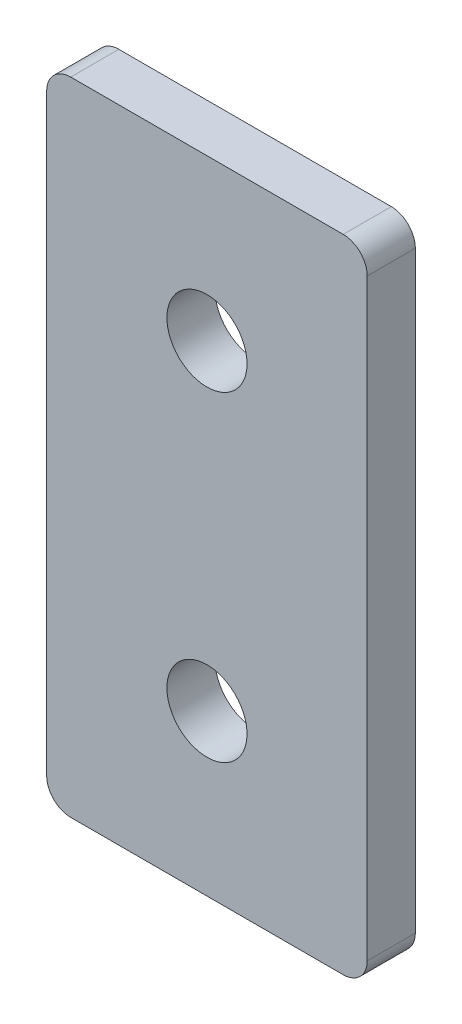
ISO-10303-21;
HEADER;
FILE_DESCRIPTION(('STEP AP214'),'2;1');
FILE_NAME('part.step','',(''),(''),'','','');
FILE_SCHEMA(('AUTOMOTIVE_DESIGN { 1 0 10303 214 1 1 1 1 }'));
ENDSEC;
DATA;
#1=APPLICATION_CONTEXT('core data for automotive mechanical design processes');
#2=APPLICATION_PROTOCOL_DEFINITION('international standard','automotive_design',2000,#1);
#3=PRODUCT_CONTEXT('',#1,'mechanical');
#4=PRODUCT('Part','Part','',(#3));
#5=PRODUCT_RELATED_PRODUCT_CATEGORY('part','',(#4));
#6=PRODUCT_DEFINITION_FORMATION('','',#4);
#7=PRODUCT_DEFINITION_CONTEXT('part definition',#1,'design');
#8=PRODUCT_DEFINITION('design','',#6,#7);
#9=PRODUCT_DEFINITION_SHAPE('','',#8);
#10=(LENGTH_UNIT() NAMED_UNIT(*) SI_UNIT(.MILLI.,.METRE.));
#11=(NAMED_UNIT(*) PLANE_ANGLE_UNIT() SI_UNIT($,.RADIAN.));
#12=(NAMED_UNIT(*) SI_UNIT($,.STERADIAN.) SOLID_ANGLE_UNIT());
#13=UNCERTAINTY_MEASURE_WITH_UNIT(LENGTH_MEASURE(1.E-05),#10,'distance_accuracy_value','');
#14=(GEOMETRIC_REPRESENTATION_CONTEXT(3) GLOBAL_UNCERTAINTY_ASSIGNED_CONTEXT((#13)) GLOBAL_UNIT_ASSIGNED_CONTEXT((#10,
#11,#12)) REPRESENTATION_CONTEXT('',''));
#15=CARTESIAN_POINT('',(0.,0.,0.));
#16=DIRECTION('',(0.,0.,1.));
#17=DIRECTION('',(1.,0.,0.));
#18=AXIS2_PLACEMENT_3D('',#15,#16,#17);
#19=CARTESIAN_POINT('',(-8.50000000000001,1.5,3.));
#20=DIRECTION('',(0.,0.,1.));
#21=DIRECTION('',(1.,0.,0.));
#22=AXIS2_PLACEMENT_3D('',#19,#20,#21);
#23=PLANE('',#22);
#24=CARTESIAN_POINT('',(0.,30.,3.));
#25=DIRECTION('',(0.,0.,1.));
#26=DIRECTION('',(1.,0.,0.));
#27=AXIS2_PLACEMENT_3D('',#24,#25,#26);
#28=CIRCLE('',#27,2.5);
#29=CARTESIAN_POINT('',(2.5,30.,3.));
#30=VERTEX_POINT('',#29);
#31=EDGE_CURVE('E134',#30,#30,#28,.T.);
#32=ORIENTED_EDGE('',*,*,#31,.F.);
#33=EDGE_LOOP('',(#32));
#34=FACE_BOUND('',#33,.T.);
#35=CARTESIAN_POINT('',(-8.50000000000001,1.5,3.));
#36=DIRECTION('',(0.,0.,1.));
#37=DIRECTION('',(1.,0.,0.));
#38=AXIS2_PLACEMENT_3D('',#35,#36,#37);
#39=CIRCLE('',#38,1.5);
#40=CARTESIAN_POINT('',(-10.,1.5,3.));
#41=VERTEX_POINT('',#40);
#42=CARTESIAN_POINT('',(-8.50000000000001,0.,3.));
#43=VERTEX_POINT('',#42);
#44=EDGE_CURVE('E145',#41,#43,#39,.T.);
#45=ORIENTED_EDGE('',*,*,#44,.T.);
#46=DIRECTION('',(1.,0.,0.));
#47=VECTOR('',#46,1.);
#48=CARTESIAN_POINT('',(8.50000000000001,0.,3.));
#49=LINE('',#48,#47);
#50=CARTESIAN_POINT('',(8.50000000000001,0.,3.));
#51=VERTEX_POINT('',#50);
#52=EDGE_CURVE('E93',#43,#51,#49,.T.);
#53=ORIENTED_EDGE('',*,*,#52,.T.);
#54=CARTESIAN_POINT('',(8.50000000000001,1.5,3.));
#55=DIRECTION('',(0.,0.,1.));
#56=DIRECTION('',(1.,0.,0.));
#57=AXIS2_PLACEMENT_3D('',#54,#55,#56);
#58=CIRCLE('',#57,1.49999999999999);
#59=CARTESIAN_POINT('',(9.99999999999998,1.5,3.));
#60=VERTEX_POINT('',#59);
#61=EDGE_CURVE('E160',#51,#60,#58,.T.);
#62=ORIENTED_EDGE('',*,*,#61,.T.);
#63=DIRECTION('',(0.,1.,0.));
#64=VECTOR('',#63,1.);
#65=CARTESIAN_POINT('',(9.99999999999998,38.5,3.));
#66=LINE('',#65,#64);
#67=CARTESIAN_POINT('',(9.99999999999999,38.5,3.));
#68=VERTEX_POINT('',#67);
#69=EDGE_CURVE('E173',#60,#68,#66,.T.);
#70=ORIENTED_EDGE('',*,*,#69,.T.);
#71=CARTESIAN_POINT('',(8.50000000000001,38.5,3.));
#72=DIRECTION('',(0.,0.,1.));
#73=DIRECTION('',(1.,0.,0.));
#74=AXIS2_PLACEMENT_3D('',#71,#72,#73);
#75=CIRCLE('',#74,1.49999999999999);
#76=CARTESIAN_POINT('',(8.50000000000001,40.,3.));
#77=VERTEX_POINT('',#76);
#78=EDGE_CURVE('E112',#68,#77,#75,.T.);
#79=ORIENTED_EDGE('',*,*,#78,.T.);
#80=DIRECTION('',(-1.,0.,0.));
#81=VECTOR('',#80,1.);
#82=CARTESIAN_POINT('',(-8.50000000000001,40.,3.));
#83=LINE('',#82,#81);
#84=CARTESIAN_POINT('',(-8.50000000000001,40.,3.));
#85=VERTEX_POINT('',#84);
#86=EDGE_CURVE('E106',#77,#85,#83,.T.);
#87=ORIENTED_EDGE('',*,*,#86,.T.);
#88=CARTESIAN_POINT('',(-8.50000000000001,38.5,3.));
#89=DIRECTION('',(0.,0.,1.));
#90=DIRECTION('',(1.,0.,0.));
#91=AXIS2_PLACEMENT_3D('',#88,#89,#90);
#92=CIRCLE('',#91,1.5);
#93=CARTESIAN_POINT('',(-10.,38.5,3.));
#94=VERTEX_POINT('',#93);
#95=EDGE_CURVE('E110',#85,#94,#92,.T.);
#96=ORIENTED_EDGE('',*,*,#95,.T.);
#97=DIRECTION('',(0.,-1.,0.));
#98=VECTOR('',#97,1.);
#99=CARTESIAN_POINT('',(-10.,1.5,3.));
#100=LINE('',#99,#98);
#101=EDGE_CURVE('E50',#94,#41,#100,.T.);
#102=ORIENTED_EDGE('',*,*,#101,.T.);
#103=EDGE_LOOP('',(#45,#53,#62,#70,#79,#87,#96,#102));
#104=FACE_BOUND('',#103,.T.);
#105=CARTESIAN_POINT('',(0.,10.,3.));
#106=DIRECTION('',(0.,0.,1.));
#107=DIRECTION('',(-1.,0.,0.));
#108=AXIS2_PLACEMENT_3D('',#105,#106,#107);
#109=CIRCLE('',#108,2.5);
#110=CARTESIAN_POINT('',(-2.5,10.,3.));
#111=VERTEX_POINT('',#110);
#112=EDGE_CURVE('E182',#111,#111,#109,.T.);
#113=ORIENTED_EDGE('',*,*,#112,.F.);
#114=EDGE_LOOP('',(#113));
#115=FACE_BOUND('',#114,.T.);
#116=ADVANCED_FACE('F33',(#34,#104,#115),#23,.T.);
#117=CARTESIAN_POINT('',(-8.50000000000001,1.5,0.));
#118=DIRECTION('',(0.,0.,1.));
#119=DIRECTION('',(1.,0.,0.));
#120=AXIS2_PLACEMENT_3D('',#117,#118,#119);
#121=PLANE('',#120);
#122=CARTESIAN_POINT('',(-8.50000000000001,1.5,0.));
#123=DIRECTION('',(0.,0.,1.));
#124=DIRECTION('',(1.,0.,0.));
#125=AXIS2_PLACEMENT_3D('',#122,#123,#124);
#126=CIRCLE('',#125,1.5);
#127=CARTESIAN_POINT('',(-10.,1.5,0.));
#128=VERTEX_POINT('',#127);
#129=CARTESIAN_POINT('',(-8.50000000000001,0.,0.));
#130=VERTEX_POINT('',#129);
#131=EDGE_CURVE('E130',#128,#130,#126,.T.);
#132=ORIENTED_EDGE('',*,*,#131,.F.);
#133=DIRECTION('',(0.,-1.,0.));
#134=VECTOR('',#133,1.);
#135=CARTESIAN_POINT('',(-10.,1.5,0.));
#136=LINE('',#135,#134);
#137=CARTESIAN_POINT('',(-10.,38.5,0.));
#138=VERTEX_POINT('',#137);
#139=EDGE_CURVE('E85',#138,#128,#136,.T.);
#140=ORIENTED_EDGE('',*,*,#139,.F.);
#141=CARTESIAN_POINT('',(-8.50000000000001,38.5,0.));
#142=DIRECTION('',(0.,0.,1.));
#143=DIRECTION('',(1.,0.,0.));
#144=AXIS2_PLACEMENT_3D('',#141,#142,#143);
#145=CIRCLE('',#144,1.5);
#146=CARTESIAN_POINT('',(-8.50000000000001,40.,0.));
#147=VERTEX_POINT('',#146);
#148=EDGE_CURVE('E79',#147,#138,#145,.T.);
#149=ORIENTED_EDGE('',*,*,#148,.F.);
#150=DIRECTION('',(-1.,0.,0.));
#151=VECTOR('',#150,1.);
#152=CARTESIAN_POINT('',(-8.50000000000001,40.,0.));
#153=LINE('',#152,#151);
#154=CARTESIAN_POINT('',(8.50000000000001,40.,0.));
#155=VERTEX_POINT('',#154);
#156=EDGE_CURVE('E120',#155,#147,#153,.T.);
#157=ORIENTED_EDGE('',*,*,#156,.F.);
#158=CARTESIAN_POINT('',(8.50000000000001,38.5,0.));
#159=DIRECTION('',(0.,0.,1.));
#160=DIRECTION('',(1.,0.,0.));
#161=AXIS2_PLACEMENT_3D('',#158,#159,#160);
#162=CIRCLE('',#161,1.49999999999999);
#163=CARTESIAN_POINT('',(9.99999999999999,38.5,0.));
#164=VERTEX_POINT('',#163);
#165=EDGE_CURVE('E140',#164,#155,#162,.T.);
#166=ORIENTED_EDGE('',*,*,#165,.F.);
#167=DIRECTION('',(0.,1.,0.));
#168=VECTOR('',#167,1.);
#169=CARTESIAN_POINT('',(9.99999999999998,38.5,0.));
#170=LINE('',#169,#168);
#171=CARTESIAN_POINT('',(9.99999999999998,1.5,0.));
#172=VERTEX_POINT('',#171);
#173=EDGE_CURVE('E138',#172,#164,#170,.T.);
#174=ORIENTED_EDGE('',*,*,#173,.F.);
#175=CARTESIAN_POINT('',(8.50000000000001,1.5,0.));
#176=DIRECTION('',(0.,0.,1.));
#177=DIRECTION('',(1.,0.,0.));
#178=AXIS2_PLACEMENT_3D('',#175,#176,#177);
#179=CIRCLE('',#178,1.49999999999999);
#180=CARTESIAN_POINT('',(8.50000000000001,0.,0.));
#181=VERTEX_POINT('',#180);
#182=EDGE_CURVE('E136',#181,#172,#179,.T.);
#183=ORIENTED_EDGE('',*,*,#182,.F.);
#184=DIRECTION('',(1.,0.,0.));
#185=VECTOR('',#184,1.);
#186=CARTESIAN_POINT('',(8.50000000000001,0.,0.));
#187=LINE('',#186,#185);
#188=EDGE_CURVE('E133',#130,#181,#187,.T.);
#189=ORIENTED_EDGE('',*,*,#188,.F.);
#190=EDGE_LOOP('',(#132,#140,#149,#157,#166,#174,#183,#189));
#191=FACE_BOUND('',#190,.T.);
#192=CARTESIAN_POINT('',(0.,30.,0.));
#193=DIRECTION('',(0.,0.,1.));
#194=DIRECTION('',(1.,0.,0.));
#195=AXIS2_PLACEMENT_3D('',#192,#193,#194);
#196=CIRCLE('',#195,2.5);
#197=CARTESIAN_POINT('',(2.5,30.,0.));
#198=VERTEX_POINT('',#197);
#199=EDGE_CURVE('E179',#198,#198,#196,.T.);
#200=ORIENTED_EDGE('',*,*,#199,.T.);
#201=EDGE_LOOP('',(#200));
#202=FACE_BOUND('',#201,.T.);
#203=CARTESIAN_POINT('',(0.,10.,0.));
#204=DIRECTION('',(0.,0.,1.));
#205=DIRECTION('',(-1.,0.,0.));
#206=AXIS2_PLACEMENT_3D('',#203,#204,#205);
#207=CIRCLE('',#206,2.5);
#208=CARTESIAN_POINT('',(-2.5,10.,0.));
#209=VERTEX_POINT('',#208);
#210=EDGE_CURVE('E185',#209,#209,#207,.T.);
#211=ORIENTED_EDGE('',*,*,#210,.T.);
#212=EDGE_LOOP('',(#211));
#213=FACE_BOUND('',#212,.T.);
#214=ADVANCED_FACE('F164',(#191,#202,#213),#121,.F.);
#215=CARTESIAN_POINT('',(-8.50000000000001,1.5,3.));
#216=DIRECTION('',(0.,0.,-1.));
#217=DIRECTION('',(-1.,0.,0.));
#218=AXIS2_PLACEMENT_3D('',#215,#216,#217);
#219=CYLINDRICAL_SURFACE('',#218,1.5);
#220=ORIENTED_EDGE('',*,*,#131,.T.);
#221=DIRECTION('',(0.,0.,-1.));
#222=VECTOR('',#221,1.);
#223=CARTESIAN_POINT('',(-8.50000000000001,0.,3.));
#224=LINE('',#223,#222);
#225=EDGE_CURVE('E11',#43,#130,#224,.T.);
#226=ORIENTED_EDGE('',*,*,#225,.F.);
#227=ORIENTED_EDGE('',*,*,#44,.F.);
#228=DIRECTION('',(0.,0.,-1.));
#229=VECTOR('',#228,1.);
#230=CARTESIAN_POINT('',(-10.,1.5,3.));
#231=LINE('',#230,#229);
#232=EDGE_CURVE('E126',#41,#128,#231,.T.);
#233=ORIENTED_EDGE('',*,*,#232,.T.);
#234=EDGE_LOOP('',(#220,#226,#227,#233));
#235=FACE_BOUND('',#234,.T.);
#236=ADVANCED_FACE('F35',(#235),#219,.T.);
#237=CARTESIAN_POINT('',(8.50000000000001,0.,3.));
#238=DIRECTION('',(0.,1.,0.));
#239=DIRECTION('',(0.,0.,1.));
#240=AXIS2_PLACEMENT_3D('',#237,#238,#239);
#241=PLANE('',#240);
#242=ORIENTED_EDGE('',*,*,#188,.T.);
#243=DIRECTION('',(0.,0.,-1.));
#244=VECTOR('',#243,1.);
#245=CARTESIAN_POINT('',(8.50000000000001,0.,3.));
#246=LINE('',#245,#244);
#247=EDGE_CURVE('E42',#51,#181,#246,.T.);
#248=ORIENTED_EDGE('',*,*,#247,.F.);
#249=ORIENTED_EDGE('',*,*,#52,.F.);
#250=ORIENTED_EDGE('',*,*,#225,.T.);
#251=EDGE_LOOP('',(#242,#248,#249,#250));
#252=FACE_BOUND('',#251,.T.);
#253=ADVANCED_FACE('F217',(#252),#241,.F.);
#254=CARTESIAN_POINT('',(8.50000000000001,1.5,3.));
#255=DIRECTION('',(0.,0.,-1.));
#256=DIRECTION('',(-1.,0.,0.));
#257=AXIS2_PLACEMENT_3D('',#254,#255,#256);
#258=CYLINDRICAL_SURFACE('',#257,1.49999999999999);
#259=ORIENTED_EDGE('',*,*,#182,.T.);
#260=DIRECTION('',(0.,0.,-1.));
#261=VECTOR('',#260,1.);
#262=CARTESIAN_POINT('',(9.99999999999998,1.5,3.));
#263=LINE('',#262,#261);
#264=EDGE_CURVE('E152',#60,#172,#263,.T.);
#265=ORIENTED_EDGE('',*,*,#264,.F.);
#266=ORIENTED_EDGE('',*,*,#61,.F.);
#267=ORIENTED_EDGE('',*,*,#247,.T.);
#268=EDGE_LOOP('',(#259,#265,#266,#267));
#269=FACE_BOUND('',#268,.T.);
#270=ADVANCED_FACE('F158',(#269),#258,.T.);
#271=CARTESIAN_POINT('',(9.99999999999998,38.5,3.));
#272=DIRECTION('',(-1.,0.,0.));
#273=DIRECTION('',(0.,0.,1.));
#274=AXIS2_PLACEMENT_3D('',#271,#272,#273);
#275=PLANE('',#274);
#276=ORIENTED_EDGE('',*,*,#173,.T.);
#277=DIRECTION('',(0.,0.,-1.));
#278=VECTOR('',#277,1.);
#279=CARTESIAN_POINT('',(9.99999999999999,38.5,3.));
#280=LINE('',#279,#278);
#281=EDGE_CURVE('E149',#68,#164,#280,.T.);
#282=ORIENTED_EDGE('',*,*,#281,.F.);
#283=ORIENTED_EDGE('',*,*,#69,.F.);
#284=ORIENTED_EDGE('',*,*,#264,.T.);
#285=EDGE_LOOP('',(#276,#282,#283,#284));
#286=FACE_BOUND('',#285,.T.);
#287=ADVANCED_FACE('F169',(#286),#275,.F.);
#288=CARTESIAN_POINT('',(8.50000000000001,38.5,3.));
#289=DIRECTION('',(0.,0.,-1.));
#290=DIRECTION('',(-1.,0.,0.));
#291=AXIS2_PLACEMENT_3D('',#288,#289,#290);
#292=CYLINDRICAL_SURFACE('',#291,1.49999999999999);
#293=ORIENTED_EDGE('',*,*,#165,.T.);
#294=DIRECTION('',(0.,0.,-1.));
#295=VECTOR('',#294,1.);
#296=CARTESIAN_POINT('',(8.50000000000001,40.,3.));
#297=LINE('',#296,#295);
#298=EDGE_CURVE('E121',#77,#155,#297,.T.);
#299=ORIENTED_EDGE('',*,*,#298,.F.);
#300=ORIENTED_EDGE('',*,*,#78,.F.);
#301=ORIENTED_EDGE('',*,*,#281,.T.);
#302=EDGE_LOOP('',(#293,#299,#300,#301));
#303=FACE_BOUND('',#302,.T.);
#304=ADVANCED_FACE('F172',(#303),#292,.T.);
#305=CARTESIAN_POINT('',(-8.50000000000001,40.,3.));
#306=DIRECTION('',(0.,-1.,0.));
#307=DIRECTION('',(0.,0.,-1.));
#308=AXIS2_PLACEMENT_3D('',#305,#306,#307);
#309=PLANE('',#308);
#310=ORIENTED_EDGE('',*,*,#156,.T.);
#311=DIRECTION('',(0.,0.,-1.));
#312=VECTOR('',#311,1.);
#313=CARTESIAN_POINT('',(-8.50000000000001,40.,3.));
#314=LINE('',#313,#312);
#315=EDGE_CURVE('E117',#85,#147,#314,.T.);
#316=ORIENTED_EDGE('',*,*,#315,.F.);
#317=ORIENTED_EDGE('',*,*,#86,.F.);
#318=ORIENTED_EDGE('',*,*,#298,.T.);
#319=EDGE_LOOP('',(#310,#316,#317,#318));
#320=FACE_BOUND('',#319,.T.);
#321=ADVANCED_FACE('F118',(#320),#309,.F.);
#322=CARTESIAN_POINT('',(-8.50000000000001,38.5,3.));
#323=DIRECTION('',(0.,0.,-1.));
#324=DIRECTION('',(-1.,0.,0.));
#325=AXIS2_PLACEMENT_3D('',#322,#323,#324);
#326=CYLINDRICAL_SURFACE('',#325,1.5);
#327=ORIENTED_EDGE('',*,*,#148,.T.);
#328=DIRECTION('',(0.,0.,-1.));
#329=VECTOR('',#328,1.);
#330=CARTESIAN_POINT('',(-10.,38.5,3.));
#331=LINE('',#330,#329);
#332=EDGE_CURVE('E122',#94,#138,#331,.T.);
#333=ORIENTED_EDGE('',*,*,#332,.F.);
#334=ORIENTED_EDGE('',*,*,#95,.F.);
#335=ORIENTED_EDGE('',*,*,#315,.T.);
#336=EDGE_LOOP('',(#327,#333,#334,#335));
#337=FACE_BOUND('',#336,.T.);
#338=ADVANCED_FACE('F124',(#337),#326,.T.);
#339=CARTESIAN_POINT('',(-10.,1.5,3.));
#340=DIRECTION('',(1.,0.,0.));
#341=DIRECTION('',(0.,0.,-1.));
#342=AXIS2_PLACEMENT_3D('',#339,#340,#341);
#343=PLANE('',#342);
#344=ORIENTED_EDGE('',*,*,#139,.T.);
#345=ORIENTED_EDGE('',*,*,#232,.F.);
#346=ORIENTED_EDGE('',*,*,#101,.F.);
#347=ORIENTED_EDGE('',*,*,#332,.T.);
#348=EDGE_LOOP('',(#344,#345,#346,#347));
#349=FACE_BOUND('',#348,.T.);
#350=ADVANCED_FACE('F205',(#349),#343,.F.);
#351=CARTESIAN_POINT('',(0.,30.,3.));
#352=DIRECTION('',(0.,0.,-1.));
#353=DIRECTION('',(-1.,0.,0.));
#354=AXIS2_PLACEMENT_3D('',#351,#352,#353);
#355=CYLINDRICAL_SURFACE('',#354,2.5);
#356=ORIENTED_EDGE('',*,*,#31,.T.);
#357=EDGE_LOOP('',(#356));
#358=FACE_BOUND('',#357,.T.);
#359=ORIENTED_EDGE('',*,*,#199,.F.);
#360=EDGE_LOOP('',(#359));
#361=FACE_BOUND('',#360,.T.);
#362=ADVANCED_FACE('F202',(#358,#361),#355,.F.);
#363=CARTESIAN_POINT('',(0.,10.,3.));
#364=DIRECTION('',(0.,0.,-1.));
#365=DIRECTION('',(-1.,0.,0.));
#366=AXIS2_PLACEMENT_3D('',#363,#364,#365);
#367=CYLINDRICAL_SURFACE('',#366,2.5);
#368=ORIENTED_EDGE('',*,*,#112,.T.);
#369=EDGE_LOOP('',(#368));
#370=FACE_BOUND('',#369,.T.);
#371=ORIENTED_EDGE('',*,*,#210,.F.);
#372=EDGE_LOOP('',(#371));
#373=FACE_BOUND('',#372,.T.);
#374=ADVANCED_FACE('F191',(#370,#373),#367,.F.);
#375=CLOSED_SHELL('',(#116,#214,#236,#253,#270,#287,#304,#321,#338,#350,#362,#374));
#376=MANIFOLD_SOLID_BREP('B2',#375);
#377=ADVANCED_BREP_SHAPE_REPRESENTATION('',(#18,#376),#14);
#378=SHAPE_DEFINITION_REPRESENTATION(#9,#377);
ENDSEC;
END-ISO-10303-21;
